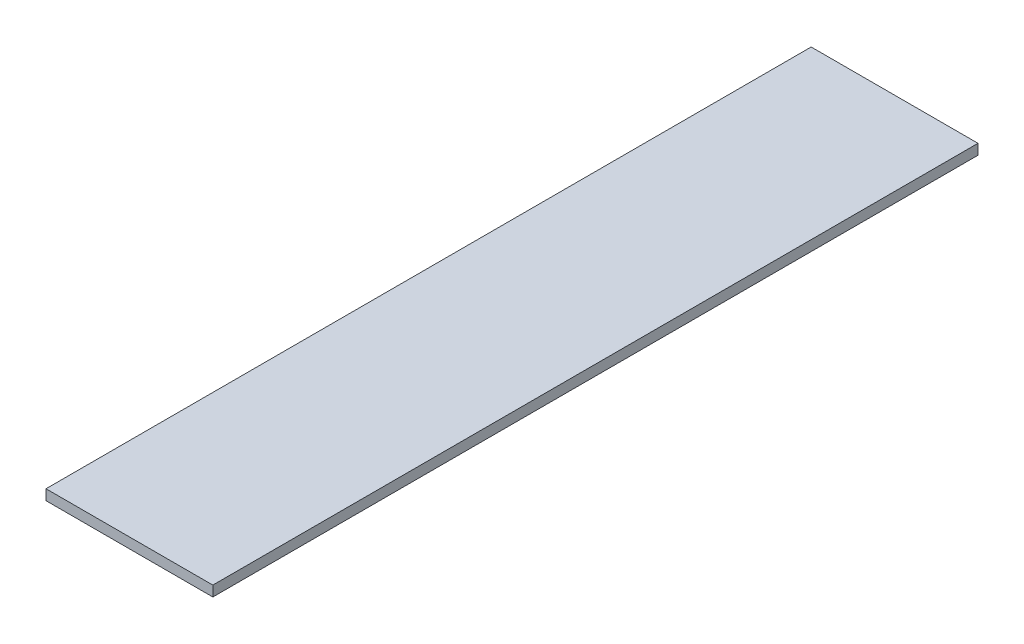
ISO-10303-21;
HEADER;
FILE_DESCRIPTION(('STEP AP214'),'2;1');
FILE_NAME('part.step','',(''),(''),'','','');
FILE_SCHEMA(('AUTOMOTIVE_DESIGN { 1 0 10303 214 1 1 1 1 }'));
ENDSEC;
DATA;
#1=APPLICATION_CONTEXT('core data for automotive mechanical design processes');
#2=APPLICATION_PROTOCOL_DEFINITION('international standard','automotive_design',2000,#1);
#3=PRODUCT_CONTEXT('',#1,'mechanical');
#4=PRODUCT('Part','Part','',(#3));
#5=PRODUCT_RELATED_PRODUCT_CATEGORY('part','',(#4));
#6=PRODUCT_DEFINITION_FORMATION('','',#4);
#7=PRODUCT_DEFINITION_CONTEXT('part definition',#1,'design');
#8=PRODUCT_DEFINITION('design','',#6,#7);
#9=PRODUCT_DEFINITION_SHAPE('','',#8);
#10=(LENGTH_UNIT() NAMED_UNIT(*) SI_UNIT(.MILLI.,.METRE.));
#11=(NAMED_UNIT(*) PLANE_ANGLE_UNIT() SI_UNIT($,.RADIAN.));
#12=(NAMED_UNIT(*) SI_UNIT($,.STERADIAN.) SOLID_ANGLE_UNIT());
#13=UNCERTAINTY_MEASURE_WITH_UNIT(LENGTH_MEASURE(1.E-05),#10,'distance_accuracy_value','');
#14=(GEOMETRIC_REPRESENTATION_CONTEXT(3) GLOBAL_UNCERTAINTY_ASSIGNED_CONTEXT((#13)) GLOBAL_UNIT_ASSIGNED_CONTEXT((#10,
#11,#12)) REPRESENTATION_CONTEXT('',''));
#15=CARTESIAN_POINT('',(0.,0.,0.));
#16=DIRECTION('',(0.,0.,1.));
#17=DIRECTION('',(1.,0.,0.));
#18=AXIS2_PLACEMENT_3D('',#15,#16,#17);
#19=CARTESIAN_POINT('',(0.,6.35,0.));
#20=DIRECTION('',(1.,0.,0.));
#21=DIRECTION('',(0.,0.,-1.));
#22=AXIS2_PLACEMENT_3D('',#19,#20,#21);
#23=PLANE('',#22);
#24=DIRECTION('',(0.,0.,1.));
#25=VECTOR('',#24,1.);
#26=CARTESIAN_POINT('',(0.,0.,0.));
#27=LINE('',#26,#25);
#28=CARTESIAN_POINT('',(0.,0.,-469.2));
#29=VERTEX_POINT('',#28);
#30=CARTESIAN_POINT('',(0.,0.,0.));
#31=VERTEX_POINT('',#30);
#32=EDGE_CURVE('E96',#29,#31,#27,.T.);
#33=ORIENTED_EDGE('',*,*,#32,.T.);
#34=DIRECTION('',(0.,-1.,0.));
#35=VECTOR('',#34,1.);
#36=CARTESIAN_POINT('',(0.,6.35,0.));
#37=LINE('',#36,#35);
#38=CARTESIAN_POINT('',(0.,6.35,0.));
#39=VERTEX_POINT('',#38);
#40=EDGE_CURVE('E11',#39,#31,#37,.T.);
#41=ORIENTED_EDGE('',*,*,#40,.F.);
#42=DIRECTION('',(0.,0.,1.));
#43=VECTOR('',#42,1.);
#44=CARTESIAN_POINT('',(0.,6.35,0.));
#45=LINE('',#44,#43);
#46=CARTESIAN_POINT('',(0.,6.35,-469.2));
#47=VERTEX_POINT('',#46);
#48=EDGE_CURVE('E84',#47,#39,#45,.T.);
#49=ORIENTED_EDGE('',*,*,#48,.F.);
#50=DIRECTION('',(0.,-1.,0.));
#51=VECTOR('',#50,1.);
#52=CARTESIAN_POINT('',(0.,6.35,-469.2));
#53=LINE('',#52,#51);
#54=EDGE_CURVE('E92',#47,#29,#53,.T.);
#55=ORIENTED_EDGE('',*,*,#54,.T.);
#56=EDGE_LOOP('',(#33,#41,#49,#55));
#57=FACE_BOUND('',#56,.T.);
#58=ADVANCED_FACE('F33',(#57),#23,.F.);
#59=CARTESIAN_POINT('',(0.,6.35,0.));
#60=DIRECTION('',(0.,0.,-1.));
#61=DIRECTION('',(-1.,0.,0.));
#62=AXIS2_PLACEMENT_3D('',#59,#60,#61);
#63=PLANE('',#62);
#64=DIRECTION('',(1.,0.,0.));
#65=VECTOR('',#64,1.);
#66=CARTESIAN_POINT('',(0.,0.,0.));
#67=LINE('',#66,#65);
#68=CARTESIAN_POINT('',(102.3,0.,0.));
#69=VERTEX_POINT('',#68);
#70=EDGE_CURVE('E88',#31,#69,#67,.T.);
#71=ORIENTED_EDGE('',*,*,#70,.T.);
#72=DIRECTION('',(0.,-1.,0.));
#73=VECTOR('',#72,1.);
#74=CARTESIAN_POINT('',(102.3,6.35,0.));
#75=LINE('',#74,#73);
#76=CARTESIAN_POINT('',(102.3,6.35,0.));
#77=VERTEX_POINT('',#76);
#78=EDGE_CURVE('E41',#77,#69,#75,.T.);
#79=ORIENTED_EDGE('',*,*,#78,.F.);
#80=DIRECTION('',(1.,0.,0.));
#81=VECTOR('',#80,1.);
#82=CARTESIAN_POINT('',(0.,6.35,0.));
#83=LINE('',#82,#81);
#84=EDGE_CURVE('E79',#39,#77,#83,.T.);
#85=ORIENTED_EDGE('',*,*,#84,.F.);
#86=ORIENTED_EDGE('',*,*,#40,.T.);
#87=EDGE_LOOP('',(#71,#79,#85,#86));
#88=FACE_BOUND('',#87,.T.);
#89=ADVANCED_FACE('F87',(#88),#63,.F.);
#90=CARTESIAN_POINT('',(102.3,6.35,0.));
#91=DIRECTION('',(-1.,0.,0.));
#92=DIRECTION('',(0.,0.,1.));
#93=AXIS2_PLACEMENT_3D('',#90,#91,#92);
#94=PLANE('',#93);
#95=DIRECTION('',(0.,0.,-1.));
#96=VECTOR('',#95,1.);
#97=CARTESIAN_POINT('',(102.3,0.,0.));
#98=LINE('',#97,#96);
#99=CARTESIAN_POINT('',(102.3,0.,-469.2));
#100=VERTEX_POINT('',#99);
#101=EDGE_CURVE('E66',#69,#100,#98,.T.);
#102=ORIENTED_EDGE('',*,*,#101,.T.);
#103=DIRECTION('',(0.,-1.,0.));
#104=VECTOR('',#103,1.);
#105=CARTESIAN_POINT('',(102.3,6.35,-469.2));
#106=LINE('',#105,#104);
#107=CARTESIAN_POINT('',(102.3,6.35,-469.2));
#108=VERTEX_POINT('',#107);
#109=EDGE_CURVE('E89',#108,#100,#106,.T.);
#110=ORIENTED_EDGE('',*,*,#109,.F.);
#111=DIRECTION('',(0.,0.,-1.));
#112=VECTOR('',#111,1.);
#113=CARTESIAN_POINT('',(102.3,6.35,0.));
#114=LINE('',#113,#112);
#115=EDGE_CURVE('E82',#77,#108,#114,.T.);
#116=ORIENTED_EDGE('',*,*,#115,.F.);
#117=ORIENTED_EDGE('',*,*,#78,.T.);
#118=EDGE_LOOP('',(#102,#110,#116,#117));
#119=FACE_BOUND('',#118,.T.);
#120=ADVANCED_FACE('F90',(#119),#94,.F.);
#121=CARTESIAN_POINT('',(0.,6.35,-469.2));
#122=DIRECTION('',(0.,0.,1.));
#123=DIRECTION('',(1.,0.,0.));
#124=AXIS2_PLACEMENT_3D('',#121,#122,#123);
#125=PLANE('',#124);
#126=DIRECTION('',(-1.,0.,0.));
#127=VECTOR('',#126,1.);
#128=CARTESIAN_POINT('',(0.,0.,-469.2));
#129=LINE('',#128,#127);
#130=EDGE_CURVE('E72',#100,#29,#129,.T.);
#131=ORIENTED_EDGE('',*,*,#130,.T.);
#132=ORIENTED_EDGE('',*,*,#54,.F.);
#133=DIRECTION('',(-1.,0.,0.));
#134=VECTOR('',#133,1.);
#135=CARTESIAN_POINT('',(0.,6.35,-469.2));
#136=LINE('',#135,#134);
#137=EDGE_CURVE('E49',#108,#47,#136,.T.);
#138=ORIENTED_EDGE('',*,*,#137,.F.);
#139=ORIENTED_EDGE('',*,*,#109,.T.);
#140=EDGE_LOOP('',(#131,#132,#138,#139));
#141=FACE_BOUND('',#140,.T.);
#142=ADVANCED_FACE('F103',(#141),#125,.F.);
#143=CARTESIAN_POINT('',(0.,6.35,0.));
#144=DIRECTION('',(0.,-1.,0.));
#145=DIRECTION('',(0.,0.,-1.));
#146=AXIS2_PLACEMENT_3D('',#143,#144,#145);
#147=PLANE('',#146);
#148=ORIENTED_EDGE('',*,*,#48,.T.);
#149=ORIENTED_EDGE('',*,*,#84,.T.);
#150=ORIENTED_EDGE('',*,*,#115,.T.);
#151=ORIENTED_EDGE('',*,*,#137,.T.);
#152=EDGE_LOOP('',(#148,#149,#150,#151));
#153=FACE_BOUND('',#152,.T.);
#154=ADVANCED_FACE('F80',(#153),#147,.F.);
#155=CARTESIAN_POINT('',(0.,0.,0.));
#156=DIRECTION('',(0.,-1.,0.));
#157=DIRECTION('',(0.,0.,-1.));
#158=AXIS2_PLACEMENT_3D('',#155,#156,#157);
#159=PLANE('',#158);
#160=ORIENTED_EDGE('',*,*,#32,.F.);
#161=ORIENTED_EDGE('',*,*,#130,.F.);
#162=ORIENTED_EDGE('',*,*,#101,.F.);
#163=ORIENTED_EDGE('',*,*,#70,.F.);
#164=EDGE_LOOP('',(#160,#161,#162,#163));
#165=FACE_BOUND('',#164,.T.);
#166=ADVANCED_FACE('F106',(#165),#159,.T.);
#167=CLOSED_SHELL('',(#58,#89,#120,#142,#154,#166));
#168=MANIFOLD_SOLID_BREP('B2',#167);
#169=ADVANCED_BREP_SHAPE_REPRESENTATION('',(#18,#168),#14);
#170=SHAPE_DEFINITION_REPRESENTATION(#9,#169);
ENDSEC;
END-ISO-10303-21;
